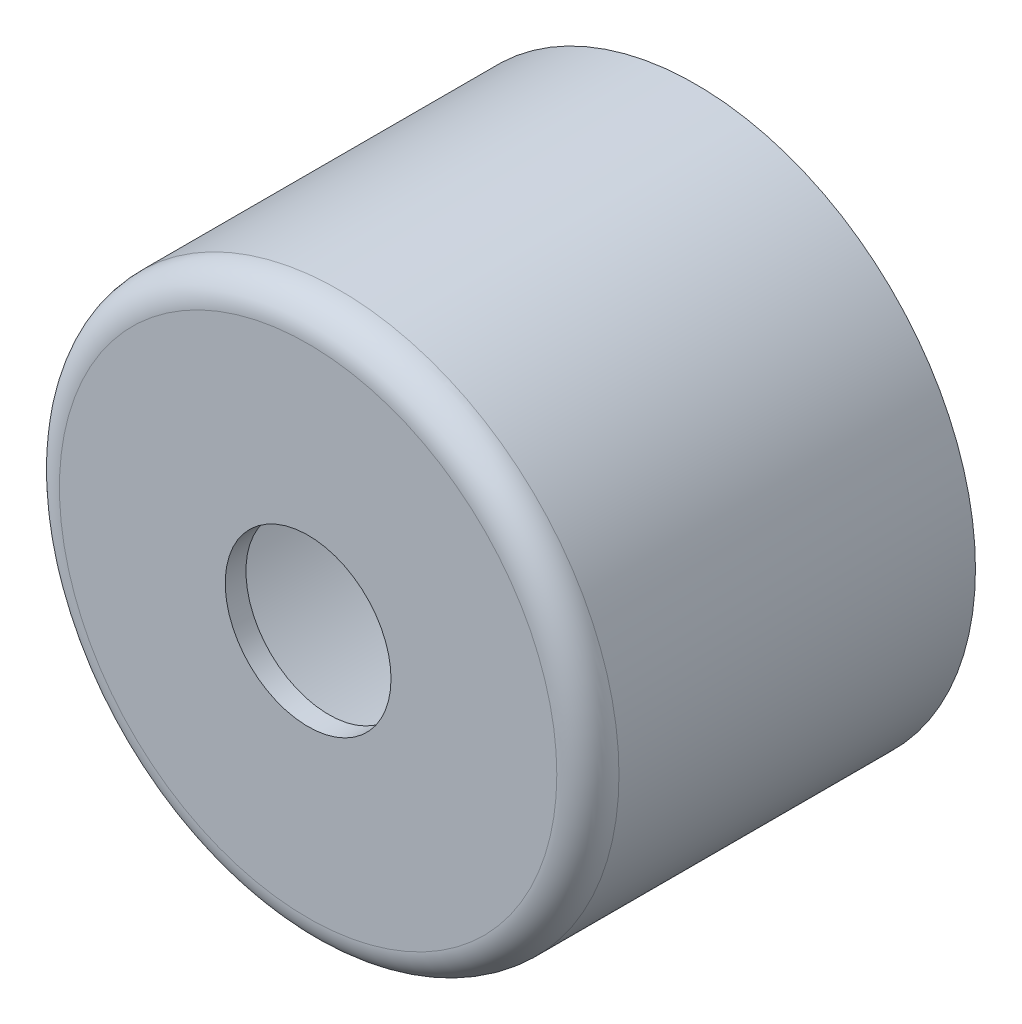
ISO-10303-21;
HEADER;
FILE_DESCRIPTION(('STEP AP214'),'2;1');
FILE_NAME('part.step','',(''),(''),'','','');
FILE_SCHEMA(('AUTOMOTIVE_DESIGN { 1 0 10303 214 1 1 1 1 }'));
ENDSEC;
DATA;
#1=APPLICATION_CONTEXT('core data for automotive mechanical design processes');
#2=APPLICATION_PROTOCOL_DEFINITION('international standard','automotive_design',2000,#1);
#3=PRODUCT_CONTEXT('',#1,'mechanical');
#4=PRODUCT('Part','Part','',(#3));
#5=PRODUCT_RELATED_PRODUCT_CATEGORY('part','',(#4));
#6=PRODUCT_DEFINITION_FORMATION('','',#4);
#7=PRODUCT_DEFINITION_CONTEXT('part definition',#1,'design');
#8=PRODUCT_DEFINITION('design','',#6,#7);
#9=PRODUCT_DEFINITION_SHAPE('','',#8);
#10=(LENGTH_UNIT() NAMED_UNIT(*) SI_UNIT(.MILLI.,.METRE.));
#11=(NAMED_UNIT(*) PLANE_ANGLE_UNIT() SI_UNIT($,.RADIAN.));
#12=(NAMED_UNIT(*) SI_UNIT($,.STERADIAN.) SOLID_ANGLE_UNIT());
#13=UNCERTAINTY_MEASURE_WITH_UNIT(LENGTH_MEASURE(1.E-05),#10,'distance_accuracy_value','');
#14=(GEOMETRIC_REPRESENTATION_CONTEXT(3) GLOBAL_UNCERTAINTY_ASSIGNED_CONTEXT((#13)) GLOBAL_UNIT_ASSIGNED_CONTEXT((#10,
#11,#12)) REPRESENTATION_CONTEXT('',''));
#15=CARTESIAN_POINT('',(0.,0.,0.));
#16=DIRECTION('',(0.,0.,1.));
#17=DIRECTION('',(1.,0.,0.));
#18=AXIS2_PLACEMENT_3D('',#15,#16,#17);
#19=CARTESIAN_POINT('',(0.,0.,18.7));
#20=DIRECTION('',(0.,0.,-1.));
#21=DIRECTION('',(-1.,0.,0.));
#22=AXIS2_PLACEMENT_3D('',#19,#20,#21);
#23=CYLINDRICAL_SURFACE('',#22,13.5);
#24=CARTESIAN_POINT('',(0.,0.,17.2));
#25=DIRECTION('',(0.,0.,1.));
#26=DIRECTION('',(1.,0.,0.));
#27=AXIS2_PLACEMENT_3D('',#24,#25,#26);
#28=CIRCLE('',#27,13.5);
#29=CARTESIAN_POINT('',(13.5,0.,17.2));
#30=VERTEX_POINT('',#29);
#31=EDGE_CURVE('E10',#30,#30,#28,.F.);
#32=ORIENTED_EDGE('',*,*,#31,.T.);
#33=EDGE_LOOP('',(#32));
#34=FACE_BOUND('',#33,.T.);
#35=CARTESIAN_POINT('',(0.,0.,0.));
#36=DIRECTION('',(0.,0.,1.));
#37=DIRECTION('',(1.,0.,0.));
#38=AXIS2_PLACEMENT_3D('',#35,#36,#37);
#39=CIRCLE('',#38,13.5);
#40=CARTESIAN_POINT('',(13.5,0.,0.));
#41=VERTEX_POINT('',#40);
#42=EDGE_CURVE('E35',#41,#41,#39,.T.);
#43=ORIENTED_EDGE('',*,*,#42,.T.);
#44=EDGE_LOOP('',(#43));
#45=FACE_BOUND('',#44,.T.);
#46=ADVANCED_FACE('F24',(#34,#45),#23,.T.);
#47=CARTESIAN_POINT('',(0.,0.,18.7));
#48=DIRECTION('',(0.,0.,1.));
#49=DIRECTION('',(1.,0.,0.));
#50=AXIS2_PLACEMENT_3D('',#47,#48,#49);
#51=PLANE('',#50);
#52=CARTESIAN_POINT('',(0.,0.,18.7));
#53=DIRECTION('',(0.,0.,1.));
#54=DIRECTION('',(1.,0.,0.));
#55=AXIS2_PLACEMENT_3D('',#52,#53,#54);
#56=CIRCLE('',#55,4.);
#57=CARTESIAN_POINT('',(4.,0.,18.7));
#58=VERTEX_POINT('',#57);
#59=EDGE_CURVE('E49',#58,#58,#56,.T.);
#60=ORIENTED_EDGE('',*,*,#59,.F.);
#61=EDGE_LOOP('',(#60));
#62=FACE_BOUND('',#61,.T.);
#63=CARTESIAN_POINT('',(0.,0.,18.7));
#64=DIRECTION('',(0.,0.,1.));
#65=DIRECTION('',(1.,0.,0.));
#66=AXIS2_PLACEMENT_3D('',#63,#64,#65);
#67=CIRCLE('',#66,12.);
#68=CARTESIAN_POINT('',(12.,0.,18.7));
#69=VERTEX_POINT('',#68);
#70=EDGE_CURVE('E31',#69,#69,#67,.T.);
#71=ORIENTED_EDGE('',*,*,#70,.T.);
#72=EDGE_LOOP('',(#71));
#73=FACE_BOUND('',#72,.T.);
#74=ADVANCED_FACE('F71',(#62,#73),#51,.T.);
#75=CARTESIAN_POINT('',(0.,0.,0.));
#76=DIRECTION('',(0.,0.,1.));
#77=DIRECTION('',(1.,0.,0.));
#78=AXIS2_PLACEMENT_3D('',#75,#76,#77);
#79=PLANE('',#78);
#80=CARTESIAN_POINT('',(0.,0.,0.));
#81=DIRECTION('',(0.,0.,1.));
#82=DIRECTION('',(1.,0.,0.));
#83=AXIS2_PLACEMENT_3D('',#80,#81,#82);
#84=CIRCLE('',#83,12.5);
#85=CARTESIAN_POINT('',(12.5,0.,0.));
#86=VERTEX_POINT('',#85);
#87=EDGE_CURVE('E41',#86,#86,#84,.T.);
#88=ORIENTED_EDGE('',*,*,#87,.T.);
#89=EDGE_LOOP('',(#88));
#90=FACE_BOUND('',#89,.T.);
#91=ORIENTED_EDGE('',*,*,#42,.F.);
#92=EDGE_LOOP('',(#91));
#93=FACE_BOUND('',#92,.T.);
#94=ADVANCED_FACE('F76',(#90,#93),#79,.F.);
#95=CARTESIAN_POINT('',(0.,0.,17.2));
#96=DIRECTION('',(0.,0.,1.));
#97=DIRECTION('',(1.,0.,0.));
#98=AXIS2_PLACEMENT_3D('',#95,#96,#97);
#99=TOROIDAL_SURFACE('',#98,12.,1.5);
#100=ORIENTED_EDGE('',*,*,#31,.F.);
#101=EDGE_LOOP('',(#100));
#102=FACE_BOUND('',#101,.T.);
#103=ORIENTED_EDGE('',*,*,#70,.F.);
#104=EDGE_LOOP('',(#103));
#105=FACE_BOUND('',#104,.T.);
#106=ADVANCED_FACE('F82',(#102,#105),#99,.T.);
#107=CARTESIAN_POINT('',(0.,0.,18.7));
#108=DIRECTION('',(0.,0.,-1.));
#109=DIRECTION('',(-1.,0.,0.));
#110=AXIS2_PLACEMENT_3D('',#107,#108,#109);
#111=CYLINDRICAL_SURFACE('',#110,12.5);
#112=CARTESIAN_POINT('',(0.,0.,17.2));
#113=DIRECTION('',(0.,0.,-1.));
#114=DIRECTION('',(-1.,0.,0.));
#115=AXIS2_PLACEMENT_3D('',#112,#113,#114);
#116=CIRCLE('',#115,12.5);
#117=CARTESIAN_POINT('',(-12.5,0.,17.2));
#118=VERTEX_POINT('',#117);
#119=EDGE_CURVE('E40',#118,#118,#116,.T.);
#120=ORIENTED_EDGE('',*,*,#119,.F.);
#121=EDGE_LOOP('',(#120));
#122=FACE_BOUND('',#121,.T.);
#123=ORIENTED_EDGE('',*,*,#87,.F.);
#124=EDGE_LOOP('',(#123));
#125=FACE_BOUND('',#124,.T.);
#126=ADVANCED_FACE('F88',(#122,#125),#111,.F.);
#127=CARTESIAN_POINT('',(0.,0.,17.7));
#128=DIRECTION('',(0.,0.,1.));
#129=DIRECTION('',(1.,0.,0.));
#130=AXIS2_PLACEMENT_3D('',#127,#128,#129);
#131=PLANE('',#130);
#132=CARTESIAN_POINT('',(0.,0.,17.7));
#133=DIRECTION('',(0.,0.,1.));
#134=DIRECTION('',(1.,0.,0.));
#135=AXIS2_PLACEMENT_3D('',#132,#133,#134);
#136=CIRCLE('',#135,4.);
#137=CARTESIAN_POINT('',(4.,0.,17.7));
#138=VERTEX_POINT('',#137);
#139=EDGE_CURVE('E27',#138,#138,#136,.T.);
#140=ORIENTED_EDGE('',*,*,#139,.T.);
#141=EDGE_LOOP('',(#140));
#142=FACE_BOUND('',#141,.T.);
#143=CARTESIAN_POINT('',(0.,0.,17.7));
#144=DIRECTION('',(0.,0.,1.));
#145=DIRECTION('',(1.,0.,0.));
#146=AXIS2_PLACEMENT_3D('',#143,#144,#145);
#147=CIRCLE('',#146,12.);
#148=CARTESIAN_POINT('',(12.,0.,17.7));
#149=VERTEX_POINT('',#148);
#150=EDGE_CURVE('E44',#149,#149,#147,.T.);
#151=ORIENTED_EDGE('',*,*,#150,.F.);
#152=EDGE_LOOP('',(#151));
#153=FACE_BOUND('',#152,.T.);
#154=ADVANCED_FACE('F56',(#142,#153),#131,.F.);
#155=CARTESIAN_POINT('',(0.,0.,17.2));
#156=DIRECTION('',(0.,0.,1.));
#157=DIRECTION('',(1.,0.,0.));
#158=AXIS2_PLACEMENT_3D('',#155,#156,#157);
#159=TOROIDAL_SURFACE('',#158,12.,0.5);
#160=ORIENTED_EDGE('',*,*,#119,.T.);
#161=EDGE_LOOP('',(#160));
#162=FACE_BOUND('',#161,.T.);
#163=ORIENTED_EDGE('',*,*,#150,.T.);
#164=EDGE_LOOP('',(#163));
#165=FACE_BOUND('',#164,.T.);
#166=ADVANCED_FACE('F61',(#162,#165),#159,.F.);
#167=CARTESIAN_POINT('',(0.,0.,0.));
#168=DIRECTION('',(0.,0.,1.));
#169=DIRECTION('',(1.,0.,0.));
#170=AXIS2_PLACEMENT_3D('',#167,#168,#169);
#171=CYLINDRICAL_SURFACE('',#170,4.);
#172=ORIENTED_EDGE('',*,*,#59,.T.);
#173=EDGE_LOOP('',(#172));
#174=FACE_BOUND('',#173,.T.);
#175=ORIENTED_EDGE('',*,*,#139,.F.);
#176=EDGE_LOOP('',(#175));
#177=FACE_BOUND('',#176,.T.);
#178=ADVANCED_FACE('F59',(#174,#177),#171,.F.);
#179=CLOSED_SHELL('',(#46,#74,#94,#106,#126,#154,#166,#178));
#180=MANIFOLD_SOLID_BREP('B2',#179);
#181=ADVANCED_BREP_SHAPE_REPRESENTATION('',(#18,#180),#14);
#182=SHAPE_DEFINITION_REPRESENTATION(#9,#181);
ENDSEC;
END-ISO-10303-21;
